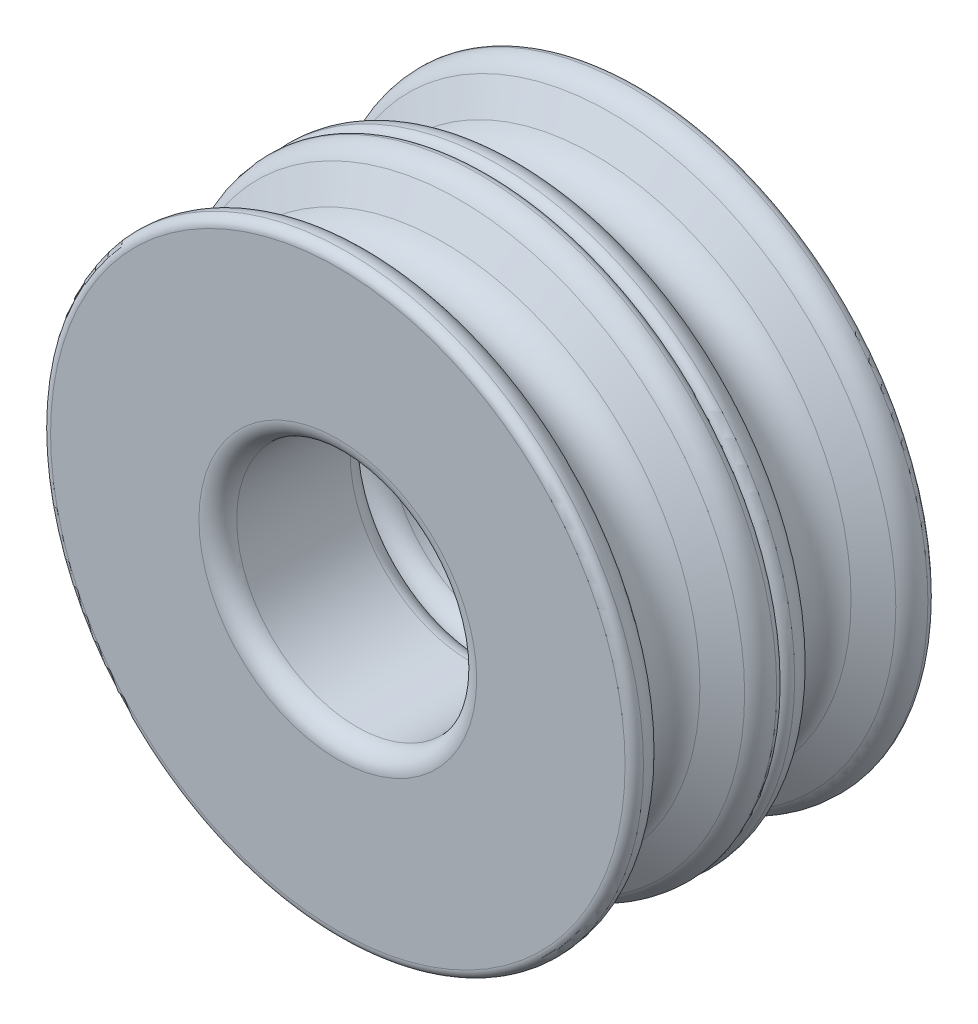
ISO-10303-21;
HEADER;
FILE_DESCRIPTION(('STEP AP214'),'2;1');
FILE_NAME('part.step','',(''),(''),'','','');
FILE_SCHEMA(('AUTOMOTIVE_DESIGN { 1 0 10303 214 1 1 1 1 }'));
ENDSEC;
DATA;
#1=APPLICATION_CONTEXT('core data for automotive mechanical design processes');
#2=APPLICATION_PROTOCOL_DEFINITION('international standard','automotive_design',2000,#1);
#3=PRODUCT_CONTEXT('',#1,'mechanical');
#4=PRODUCT('Part','Part','',(#3));
#5=PRODUCT_RELATED_PRODUCT_CATEGORY('part','',(#4));
#6=PRODUCT_DEFINITION_FORMATION('','',#4);
#7=PRODUCT_DEFINITION_CONTEXT('part definition',#1,'design');
#8=PRODUCT_DEFINITION('design','',#6,#7);
#9=PRODUCT_DEFINITION_SHAPE('','',#8);
#10=(LENGTH_UNIT() NAMED_UNIT(*) SI_UNIT(.MILLI.,.METRE.));
#11=(NAMED_UNIT(*) PLANE_ANGLE_UNIT() SI_UNIT($,.RADIAN.));
#12=(NAMED_UNIT(*) SI_UNIT($,.STERADIAN.) SOLID_ANGLE_UNIT());
#13=UNCERTAINTY_MEASURE_WITH_UNIT(LENGTH_MEASURE(1.E-05),#10,'distance_accuracy_value','');
#14=(GEOMETRIC_REPRESENTATION_CONTEXT(3) GLOBAL_UNCERTAINTY_ASSIGNED_CONTEXT((#13)) GLOBAL_UNIT_ASSIGNED_CONTEXT((#10,
#11,#12)) REPRESENTATION_CONTEXT('',''));
#15=CARTESIAN_POINT('',(0.,0.,0.));
#16=DIRECTION('',(0.,0.,1.));
#17=DIRECTION('',(1.,0.,0.));
#18=AXIS2_PLACEMENT_3D('',#15,#16,#17);
#19=CARTESIAN_POINT('',(0.,0.,-3.5));
#20=DIRECTION('',(0.,0.,-1.));
#21=DIRECTION('',(-1.,0.,0.));
#22=AXIS2_PLACEMENT_3D('',#19,#20,#21);
#23=TOROIDAL_SURFACE('',#22,15.2006264756117,0.499999999999999);
#24=CARTESIAN_POINT('',(0.,0.,-3.52502165342211));
#25=DIRECTION('',(0.,0.,-1.));
#26=DIRECTION('',(-1.,0.,0.));
#27=AXIS2_PLACEMENT_3D('',#24,#25,#26);
#28=CIRCLE('',#27,15.7);
#29=CARTESIAN_POINT('',(-15.7,0.,-3.52502165342211));
#30=VERTEX_POINT('',#29);
#31=EDGE_CURVE('E51',#30,#30,#28,.T.);
#32=ORIENTED_EDGE('',*,*,#31,.T.);
#33=EDGE_LOOP('',(#32));
#34=FACE_BOUND('',#33,.T.);
#35=CARTESIAN_POINT('',(0.,0.,-4.));
#36=DIRECTION('',(0.,0.,-1.));
#37=DIRECTION('',(-1.,0.,0.));
#38=AXIS2_PLACEMENT_3D('',#35,#36,#37);
#39=CIRCLE('',#38,15.2006264756117);
#40=CARTESIAN_POINT('',(-15.2006264756117,0.,-4.));
#41=VERTEX_POINT('',#40);
#42=EDGE_CURVE('E69',#41,#41,#39,.T.);
#43=ORIENTED_EDGE('',*,*,#42,.F.);
#44=EDGE_LOOP('',(#43));
#45=FACE_BOUND('',#44,.T.);
#46=ADVANCED_FACE('F31',(#34,#45),#23,.T.);
#47=CARTESIAN_POINT('',(0.,0.,-3.46496968520905));
#48=DIRECTION('',(0.,0.,-1.));
#49=DIRECTION('',(-1.,0.,0.));
#50=AXIS2_PLACEMENT_3D('',#47,#48,#49);
#51=TOROIDAL_SURFACE('',#50,14.501503541468,1.2);
#52=CARTESIAN_POINT('',(0.,0.,-2.42573920066772));
#53=DIRECTION('',(0.,0.,-1.));
#54=DIRECTION('',(-1.,0.,0.));
#55=AXIS2_PLACEMENT_3D('',#52,#53,#54);
#56=CIRCLE('',#55,15.101503541468);
#57=CARTESIAN_POINT('',(-15.101503541468,0.,-2.42573920066772));
#58=VERTEX_POINT('',#57);
#59=EDGE_CURVE('E54',#58,#58,#56,.T.);
#60=ORIENTED_EDGE('',*,*,#59,.T.);
#61=EDGE_LOOP('',(#60));
#62=FACE_BOUND('',#61,.T.);
#63=ORIENTED_EDGE('',*,*,#31,.F.);
#64=EDGE_LOOP('',(#63));
#65=FACE_BOUND('',#64,.T.);
#66=ADVANCED_FACE('F126',(#62,#65),#51,.T.);
#67=CARTESIAN_POINT('',(0.,0.,-2.42573920066772));
#68=DIRECTION('',(0.,0.,-1.));
#69=DIRECTION('',(-1.,0.,0.));
#70=AXIS2_PLACEMENT_3D('',#67,#68,#69);
#71=CONICAL_SURFACE('',#70,15.101503541468,1.0471975511966);
#72=CARTESIAN_POINT('',(0.,0.,-1.55884572681199));
#73=DIRECTION('',(0.,0.,-1.));
#74=DIRECTION('',(-1.,0.,0.));
#75=AXIS2_PLACEMENT_3D('',#72,#73,#74);
#76=CIRCLE('',#75,13.6);
#77=CARTESIAN_POINT('',(-13.6,0.,-1.55884572681199));
#78=VERTEX_POINT('',#77);
#79=EDGE_CURVE('E57',#78,#78,#76,.T.);
#80=ORIENTED_EDGE('',*,*,#79,.T.);
#81=EDGE_LOOP('',(#80));
#82=FACE_BOUND('',#81,.T.);
#83=ORIENTED_EDGE('',*,*,#59,.F.);
#84=EDGE_LOOP('',(#83));
#85=FACE_BOUND('',#84,.T.);
#86=ADVANCED_FACE('F132',(#82,#85),#71,.T.);
#87=CARTESIAN_POINT('',(0.,0.,0.));
#88=DIRECTION('',(0.,0.,-1.));
#89=DIRECTION('',(-1.,0.,0.));
#90=AXIS2_PLACEMENT_3D('',#87,#88,#89);
#91=TOROIDAL_SURFACE('',#90,14.5,1.8);
#92=CARTESIAN_POINT('',(0.,0.,1.55884572681199));
#93=DIRECTION('',(0.,0.,-1.));
#94=DIRECTION('',(-1.,0.,0.));
#95=AXIS2_PLACEMENT_3D('',#92,#93,#94);
#96=CIRCLE('',#95,13.6);
#97=CARTESIAN_POINT('',(-13.6,0.,1.55884572681199));
#98=VERTEX_POINT('',#97);
#99=EDGE_CURVE('E60',#98,#98,#96,.T.);
#100=ORIENTED_EDGE('',*,*,#99,.T.);
#101=EDGE_LOOP('',(#100));
#102=FACE_BOUND('',#101,.T.);
#103=ORIENTED_EDGE('',*,*,#79,.F.);
#104=EDGE_LOOP('',(#103));
#105=FACE_BOUND('',#104,.T.);
#106=ADVANCED_FACE('F173',(#102,#105),#91,.F.);
#107=CARTESIAN_POINT('',(0.,0.,1.55884572681199));
#108=DIRECTION('',(0.,0.,1.));
#109=DIRECTION('',(1.,0.,0.));
#110=AXIS2_PLACEMENT_3D('',#107,#108,#109);
#111=CONICAL_SURFACE('',#110,13.6,1.0471975511966);
#112=CARTESIAN_POINT('',(0.,0.,2.42573920066772));
#113=DIRECTION('',(0.,0.,-1.));
#114=DIRECTION('',(-1.,0.,0.));
#115=AXIS2_PLACEMENT_3D('',#112,#113,#114);
#116=CIRCLE('',#115,15.101503541468);
#117=CARTESIAN_POINT('',(-15.101503541468,0.,2.42573920066772));
#118=VERTEX_POINT('',#117);
#119=EDGE_CURVE('E63',#118,#118,#116,.T.);
#120=ORIENTED_EDGE('',*,*,#119,.T.);
#121=EDGE_LOOP('',(#120));
#122=FACE_BOUND('',#121,.T.);
#123=ORIENTED_EDGE('',*,*,#99,.F.);
#124=EDGE_LOOP('',(#123));
#125=FACE_BOUND('',#124,.T.);
#126=ADVANCED_FACE('F169',(#122,#125),#111,.T.);
#127=CARTESIAN_POINT('',(0.,0.,3.46496968520905));
#128=DIRECTION('',(0.,0.,-1.));
#129=DIRECTION('',(-1.,0.,0.));
#130=AXIS2_PLACEMENT_3D('',#127,#128,#129);
#131=TOROIDAL_SURFACE('',#130,14.501503541468,1.2);
#132=CARTESIAN_POINT('',(0.,0.,3.52502165342211));
#133=DIRECTION('',(0.,0.,-1.));
#134=DIRECTION('',(-1.,0.,0.));
#135=AXIS2_PLACEMENT_3D('',#132,#133,#134);
#136=CIRCLE('',#135,15.7);
#137=CARTESIAN_POINT('',(-15.7,0.,3.52502165342211));
#138=VERTEX_POINT('',#137);
#139=EDGE_CURVE('E66',#138,#138,#136,.T.);
#140=ORIENTED_EDGE('',*,*,#139,.T.);
#141=EDGE_LOOP('',(#140));
#142=FACE_BOUND('',#141,.T.);
#143=ORIENTED_EDGE('',*,*,#119,.F.);
#144=EDGE_LOOP('',(#143));
#145=FACE_BOUND('',#144,.T.);
#146=ADVANCED_FACE('F165',(#142,#145),#131,.T.);
#147=CARTESIAN_POINT('',(0.,0.,3.5));
#148=DIRECTION('',(0.,0.,-1.));
#149=DIRECTION('',(-1.,0.,0.));
#150=AXIS2_PLACEMENT_3D('',#147,#148,#149);
#151=TOROIDAL_SURFACE('',#150,15.2006264756117,0.499999999999999);
#152=CARTESIAN_POINT('',(0.,0.,3.99999999999534));
#153=DIRECTION('',(0.,0.,-1.));
#154=DIRECTION('',(-1.,0.,0.));
#155=AXIS2_PLACEMENT_3D('',#152,#153,#154);
#156=CIRCLE('',#155,15.2006264756117);
#157=CARTESIAN_POINT('',(-15.2006264756117,0.,3.99999999999534));
#158=VERTEX_POINT('',#157);
#159=EDGE_CURVE('E99',#158,#158,#156,.T.);
#160=ORIENTED_EDGE('',*,*,#159,.T.);
#161=EDGE_LOOP('',(#160));
#162=FACE_BOUND('',#161,.T.);
#163=ORIENTED_EDGE('',*,*,#139,.F.);
#164=EDGE_LOOP('',(#163));
#165=FACE_BOUND('',#164,.T.);
#166=ADVANCED_FACE('F157',(#162,#165),#151,.T.);
#167=CARTESIAN_POINT('',(0.,0.,-3.99999999999767));
#168=DIRECTION('',(0.,0.,-1.));
#169=DIRECTION('',(-1.,0.,0.));
#170=AXIS2_PLACEMENT_3D('',#167,#168,#169);
#171=PLANE('',#170);
#172=CARTESIAN_POINT('',(0.,0.,-3.99999999999767));
#173=DIRECTION('',(0.,0.,-1.));
#174=DIRECTION('',(-1.,0.,0.));
#175=AXIS2_PLACEMENT_3D('',#172,#173,#174);
#176=CIRCLE('',#175,7.35);
#177=CARTESIAN_POINT('',(-7.35,0.,-3.99999999999767));
#178=VERTEX_POINT('',#177);
#179=EDGE_CURVE('E10',#178,#178,#176,.F.);
#180=ORIENTED_EDGE('',*,*,#179,.T.);
#181=EDGE_LOOP('',(#180));
#182=FACE_BOUND('',#181,.T.);
#183=ORIENTED_EDGE('',*,*,#42,.T.);
#184=EDGE_LOOP('',(#183));
#185=FACE_BOUND('',#184,.T.);
#186=ADVANCED_FACE('F146',(#182,#185),#171,.T.);
#187=CARTESIAN_POINT('',(0.,0.,6.00000000000233));
#188=DIRECTION('',(0.,0.,-1.));
#189=DIRECTION('',(-1.,0.,0.));
#190=AXIS2_PLACEMENT_3D('',#187,#188,#189);
#191=CYLINDRICAL_SURFACE('',#190,6.35);
#192=CARTESIAN_POINT('',(0.,0.,2.99999999999767));
#193=DIRECTION('',(0.,0.,1.));
#194=DIRECTION('',(1.,0.,0.));
#195=AXIS2_PLACEMENT_3D('',#192,#193,#194);
#196=CIRCLE('',#195,6.35);
#197=CARTESIAN_POINT('',(6.35,0.,2.99999999999767));
#198=VERTEX_POINT('',#197);
#199=EDGE_CURVE('E42',#198,#198,#196,.T.);
#200=ORIENTED_EDGE('',*,*,#199,.T.);
#201=EDGE_LOOP('',(#200));
#202=FACE_BOUND('',#201,.T.);
#203=CARTESIAN_POINT('',(0.,0.,-2.99999999999767));
#204=DIRECTION('',(0.,0.,-1.));
#205=DIRECTION('',(-1.,0.,0.));
#206=AXIS2_PLACEMENT_3D('',#203,#204,#205);
#207=CIRCLE('',#206,6.35);
#208=CARTESIAN_POINT('',(-6.35,0.,-2.99999999999767));
#209=VERTEX_POINT('',#208);
#210=EDGE_CURVE('E46',#209,#209,#207,.T.);
#211=ORIENTED_EDGE('',*,*,#210,.T.);
#212=EDGE_LOOP('',(#211));
#213=FACE_BOUND('',#212,.T.);
#214=ADVANCED_FACE('F139',(#202,#213),#191,.F.);
#215=CARTESIAN_POINT('',(0.,0.,2.99999999999767));
#216=DIRECTION('',(0.,0.,1.));
#217=DIRECTION('',(1.,0.,0.));
#218=AXIS2_PLACEMENT_3D('',#215,#216,#217);
#219=TOROIDAL_SURFACE('',#218,7.35,1.);
#220=CARTESIAN_POINT('',(0.,0.,3.99999999999767));
#221=DIRECTION('',(0.,0.,1.));
#222=DIRECTION('',(1.,0.,0.));
#223=AXIS2_PLACEMENT_3D('',#220,#221,#222);
#224=CIRCLE('',#223,7.35);
#225=CARTESIAN_POINT('',(7.35,0.,3.99999999999767));
#226=VERTEX_POINT('',#225);
#227=EDGE_CURVE('E38',#226,#226,#224,.F.);
#228=ORIENTED_EDGE('',*,*,#227,.F.);
#229=EDGE_LOOP('',(#228));
#230=FACE_BOUND('',#229,.T.);
#231=ORIENTED_EDGE('',*,*,#199,.F.);
#232=EDGE_LOOP('',(#231));
#233=FACE_BOUND('',#232,.T.);
#234=ADVANCED_FACE('F137',(#230,#233),#219,.T.);
#235=CARTESIAN_POINT('',(0.,0.,-2.99999999999767));
#236=DIRECTION('',(0.,0.,-1.));
#237=DIRECTION('',(-1.,0.,0.));
#238=AXIS2_PLACEMENT_3D('',#235,#236,#237);
#239=TOROIDAL_SURFACE('',#238,7.35,1.);
#240=ORIENTED_EDGE('',*,*,#179,.F.);
#241=EDGE_LOOP('',(#240));
#242=FACE_BOUND('',#241,.T.);
#243=ORIENTED_EDGE('',*,*,#210,.F.);
#244=EDGE_LOOP('',(#243));
#245=FACE_BOUND('',#244,.T.);
#246=ADVANCED_FACE('F33',(#242,#245),#239,.T.);
#247=CARTESIAN_POINT('',(0.,0.,11.4999999999953));
#248=DIRECTION('',(0.,0.,1.));
#249=DIRECTION('',(-1.,0.,0.));
#250=AXIS2_PLACEMENT_3D('',#247,#248,#249);
#251=TOROIDAL_SURFACE('',#250,15.2006264756117,0.499999999999999);
#252=CARTESIAN_POINT('',(0.,0.,11.5250216534174));
#253=DIRECTION('',(0.,0.,-1.));
#254=DIRECTION('',(-1.,0.,0.));
#255=AXIS2_PLACEMENT_3D('',#252,#253,#254);
#256=CIRCLE('',#255,15.7);
#257=CARTESIAN_POINT('',(-15.7,0.,11.5250216534174));
#258=VERTEX_POINT('',#257);
#259=EDGE_CURVE('E81',#258,#258,#256,.T.);
#260=ORIENTED_EDGE('',*,*,#259,.F.);
#261=EDGE_LOOP('',(#260));
#262=FACE_BOUND('',#261,.T.);
#263=CARTESIAN_POINT('',(0.,0.,11.9999999999953));
#264=DIRECTION('',(0.,0.,-1.));
#265=DIRECTION('',(-1.,0.,0.));
#266=AXIS2_PLACEMENT_3D('',#263,#264,#265);
#267=CIRCLE('',#266,15.2006264756117);
#268=CARTESIAN_POINT('',(-15.2006264756117,0.,11.9999999999953));
#269=VERTEX_POINT('',#268);
#270=EDGE_CURVE('E102',#269,#269,#267,.T.);
#271=ORIENTED_EDGE('',*,*,#270,.T.);
#272=EDGE_LOOP('',(#271));
#273=FACE_BOUND('',#272,.T.);
#274=ADVANCED_FACE('F106',(#262,#273),#251,.T.);
#275=CARTESIAN_POINT('',(0.,0.,11.4649696852044));
#276=DIRECTION('',(0.,0.,1.));
#277=DIRECTION('',(-1.,0.,0.));
#278=AXIS2_PLACEMENT_3D('',#275,#276,#277);
#279=TOROIDAL_SURFACE('',#278,14.501503541468,1.2);
#280=CARTESIAN_POINT('',(0.,0.,10.4257392006631));
#281=DIRECTION('',(0.,0.,-1.));
#282=DIRECTION('',(-1.,0.,0.));
#283=AXIS2_PLACEMENT_3D('',#280,#281,#282);
#284=CIRCLE('',#283,15.101503541468);
#285=CARTESIAN_POINT('',(-15.101503541468,0.,10.4257392006631));
#286=VERTEX_POINT('',#285);
#287=EDGE_CURVE('E84',#286,#286,#284,.T.);
#288=ORIENTED_EDGE('',*,*,#287,.F.);
#289=EDGE_LOOP('',(#288));
#290=FACE_BOUND('',#289,.T.);
#291=ORIENTED_EDGE('',*,*,#259,.T.);
#292=EDGE_LOOP('',(#291));
#293=FACE_BOUND('',#292,.T.);
#294=ADVANCED_FACE('F245',(#290,#293),#279,.T.);
#295=CARTESIAN_POINT('',(0.,0.,10.4257392006631));
#296=DIRECTION('',(0.,0.,1.));
#297=DIRECTION('',(-1.,0.,0.));
#298=AXIS2_PLACEMENT_3D('',#295,#296,#297);
#299=CONICAL_SURFACE('',#298,15.101503541468,1.0471975511966);
#300=CARTESIAN_POINT('',(0.,0.,9.55884572680733));
#301=DIRECTION('',(0.,0.,-1.));
#302=DIRECTION('',(-1.,0.,0.));
#303=AXIS2_PLACEMENT_3D('',#300,#301,#302);
#304=CIRCLE('',#303,13.6);
#305=CARTESIAN_POINT('',(-13.6,0.,9.55884572680733));
#306=VERTEX_POINT('',#305);
#307=EDGE_CURVE('E87',#306,#306,#304,.T.);
#308=ORIENTED_EDGE('',*,*,#307,.F.);
#309=EDGE_LOOP('',(#308));
#310=FACE_BOUND('',#309,.T.);
#311=ORIENTED_EDGE('',*,*,#287,.T.);
#312=EDGE_LOOP('',(#311));
#313=FACE_BOUND('',#312,.T.);
#314=ADVANCED_FACE('F252',(#310,#313),#299,.T.);
#315=CARTESIAN_POINT('',(0.,0.,7.99999999999534));
#316=DIRECTION('',(0.,0.,1.));
#317=DIRECTION('',(-1.,0.,0.));
#318=AXIS2_PLACEMENT_3D('',#315,#316,#317);
#319=TOROIDAL_SURFACE('',#318,14.5,1.8);
#320=CARTESIAN_POINT('',(0.,0.,6.44115427318335));
#321=DIRECTION('',(0.,0.,-1.));
#322=DIRECTION('',(-1.,0.,0.));
#323=AXIS2_PLACEMENT_3D('',#320,#321,#322);
#324=CIRCLE('',#323,13.6);
#325=CARTESIAN_POINT('',(-13.6,0.,6.44115427318335));
#326=VERTEX_POINT('',#325);
#327=EDGE_CURVE('E90',#326,#326,#324,.T.);
#328=ORIENTED_EDGE('',*,*,#327,.F.);
#329=EDGE_LOOP('',(#328));
#330=FACE_BOUND('',#329,.T.);
#331=ORIENTED_EDGE('',*,*,#307,.T.);
#332=EDGE_LOOP('',(#331));
#333=FACE_BOUND('',#332,.T.);
#334=ADVANCED_FACE('F260',(#330,#333),#319,.F.);
#335=CARTESIAN_POINT('',(0.,0.,6.44115427318335));
#336=DIRECTION('',(0.,0.,-1.));
#337=DIRECTION('',(1.,0.,0.));
#338=AXIS2_PLACEMENT_3D('',#335,#336,#337);
#339=CONICAL_SURFACE('',#338,13.6,1.0471975511966);
#340=CARTESIAN_POINT('',(0.,0.,5.57426079932762));
#341=DIRECTION('',(0.,0.,-1.));
#342=DIRECTION('',(-1.,0.,0.));
#343=AXIS2_PLACEMENT_3D('',#340,#341,#342);
#344=CIRCLE('',#343,15.101503541468);
#345=CARTESIAN_POINT('',(-15.101503541468,0.,5.57426079932762));
#346=VERTEX_POINT('',#345);
#347=EDGE_CURVE('E93',#346,#346,#344,.T.);
#348=ORIENTED_EDGE('',*,*,#347,.F.);
#349=EDGE_LOOP('',(#348));
#350=FACE_BOUND('',#349,.T.);
#351=ORIENTED_EDGE('',*,*,#327,.T.);
#352=EDGE_LOOP('',(#351));
#353=FACE_BOUND('',#352,.T.);
#354=ADVANCED_FACE('F268',(#350,#353),#339,.T.);
#355=CARTESIAN_POINT('',(0.,0.,4.53503031478629));
#356=DIRECTION('',(0.,0.,1.));
#357=DIRECTION('',(-1.,0.,0.));
#358=AXIS2_PLACEMENT_3D('',#355,#356,#357);
#359=TOROIDAL_SURFACE('',#358,14.501503541468,1.2);
#360=CARTESIAN_POINT('',(0.,0.,4.47497834657323));
#361=DIRECTION('',(0.,0.,-1.));
#362=DIRECTION('',(-1.,0.,0.));
#363=AXIS2_PLACEMENT_3D('',#360,#361,#362);
#364=CIRCLE('',#363,15.7);
#365=CARTESIAN_POINT('',(-15.7,0.,4.47497834657323));
#366=VERTEX_POINT('',#365);
#367=EDGE_CURVE('E96',#366,#366,#364,.T.);
#368=ORIENTED_EDGE('',*,*,#367,.F.);
#369=EDGE_LOOP('',(#368));
#370=FACE_BOUND('',#369,.T.);
#371=ORIENTED_EDGE('',*,*,#347,.T.);
#372=EDGE_LOOP('',(#371));
#373=FACE_BOUND('',#372,.T.);
#374=ADVANCED_FACE('F121',(#370,#373),#359,.T.);
#375=CARTESIAN_POINT('',(0.,0.,4.49999999999534));
#376=DIRECTION('',(0.,0.,1.));
#377=DIRECTION('',(-1.,0.,0.));
#378=AXIS2_PLACEMENT_3D('',#375,#376,#377);
#379=TOROIDAL_SURFACE('',#378,15.2006264756117,0.499999999999999);
#380=ORIENTED_EDGE('',*,*,#159,.F.);
#381=EDGE_LOOP('',(#380));
#382=FACE_BOUND('',#381,.T.);
#383=ORIENTED_EDGE('',*,*,#367,.T.);
#384=EDGE_LOOP('',(#383));
#385=FACE_BOUND('',#384,.T.);
#386=ADVANCED_FACE('F111',(#382,#385),#379,.T.);
#387=CARTESIAN_POINT('',(0.,0.,11.999999999993));
#388=DIRECTION('',(0.,0.,1.));
#389=DIRECTION('',(-1.,0.,0.));
#390=AXIS2_PLACEMENT_3D('',#387,#388,#389);
#391=PLANE('',#390);
#392=CARTESIAN_POINT('',(0.,0.,11.999999999993));
#393=DIRECTION('',(0.,0.,-1.));
#394=DIRECTION('',(-1.,0.,0.));
#395=AXIS2_PLACEMENT_3D('',#392,#393,#394);
#396=CIRCLE('',#395,7.35);
#397=CARTESIAN_POINT('',(-7.35,0.,11.999999999993));
#398=VERTEX_POINT('',#397);
#399=EDGE_CURVE('E72',#398,#398,#396,.F.);
#400=ORIENTED_EDGE('',*,*,#399,.F.);
#401=EDGE_LOOP('',(#400));
#402=FACE_BOUND('',#401,.T.);
#403=ORIENTED_EDGE('',*,*,#270,.F.);
#404=EDGE_LOOP('',(#403));
#405=FACE_BOUND('',#404,.T.);
#406=ADVANCED_FACE('F108',(#402,#405),#391,.T.);
#407=CARTESIAN_POINT('',(0.,0.,1.99999999999301));
#408=DIRECTION('',(0.,0.,1.));
#409=DIRECTION('',(-1.,0.,0.));
#410=AXIS2_PLACEMENT_3D('',#407,#408,#409);
#411=CYLINDRICAL_SURFACE('',#410,6.35);
#412=CARTESIAN_POINT('',(0.,0.,4.99999999999767));
#413=DIRECTION('',(0.,0.,1.));
#414=DIRECTION('',(1.,0.,0.));
#415=AXIS2_PLACEMENT_3D('',#412,#413,#414);
#416=CIRCLE('',#415,6.35);
#417=CARTESIAN_POINT('',(6.35,0.,4.99999999999767));
#418=VERTEX_POINT('',#417);
#419=EDGE_CURVE('E75',#418,#418,#416,.T.);
#420=ORIENTED_EDGE('',*,*,#419,.F.);
#421=EDGE_LOOP('',(#420));
#422=FACE_BOUND('',#421,.T.);
#423=CARTESIAN_POINT('',(0.,0.,10.999999999993));
#424=DIRECTION('',(0.,0.,-1.));
#425=DIRECTION('',(-1.,0.,0.));
#426=AXIS2_PLACEMENT_3D('',#423,#424,#425);
#427=CIRCLE('',#426,6.35);
#428=CARTESIAN_POINT('',(-6.35,0.,10.999999999993));
#429=VERTEX_POINT('',#428);
#430=EDGE_CURVE('E78',#429,#429,#427,.T.);
#431=ORIENTED_EDGE('',*,*,#430,.F.);
#432=EDGE_LOOP('',(#431));
#433=FACE_BOUND('',#432,.T.);
#434=ADVANCED_FACE('F110',(#422,#433),#411,.F.);
#435=CARTESIAN_POINT('',(0.,0.,4.99999999999767));
#436=DIRECTION('',(0.,0.,-1.));
#437=DIRECTION('',(1.,0.,0.));
#438=AXIS2_PLACEMENT_3D('',#435,#436,#437);
#439=TOROIDAL_SURFACE('',#438,7.35,1.);
#440=ORIENTED_EDGE('',*,*,#227,.T.);
#441=EDGE_LOOP('',(#440));
#442=FACE_BOUND('',#441,.T.);
#443=ORIENTED_EDGE('',*,*,#419,.T.);
#444=EDGE_LOOP('',(#443));
#445=FACE_BOUND('',#444,.T.);
#446=ADVANCED_FACE('F118',(#442,#445),#439,.T.);
#447=CARTESIAN_POINT('',(0.,0.,10.999999999993));
#448=DIRECTION('',(0.,0.,1.));
#449=DIRECTION('',(-1.,0.,0.));
#450=AXIS2_PLACEMENT_3D('',#447,#448,#449);
#451=TOROIDAL_SURFACE('',#450,7.35,1.);
#452=ORIENTED_EDGE('',*,*,#399,.T.);
#453=EDGE_LOOP('',(#452));
#454=FACE_BOUND('',#453,.T.);
#455=ORIENTED_EDGE('',*,*,#430,.T.);
#456=EDGE_LOOP('',(#455));
#457=FACE_BOUND('',#456,.T.);
#458=ADVANCED_FACE('F160',(#454,#457),#451,.T.);
#459=CLOSED_SHELL('',(#46,#66,#86,#106,#126,#146,#166,#186,#214,#234,#246,#274,#294,#314,#334,
#354,#374,#386,#406,#434,#446,#458));
#460=MANIFOLD_SOLID_BREP('B2',#459);
#461=ADVANCED_BREP_SHAPE_REPRESENTATION('',(#18,#460),#14);
#462=SHAPE_DEFINITION_REPRESENTATION(#9,#461);
ENDSEC;
END-ISO-10303-21;
